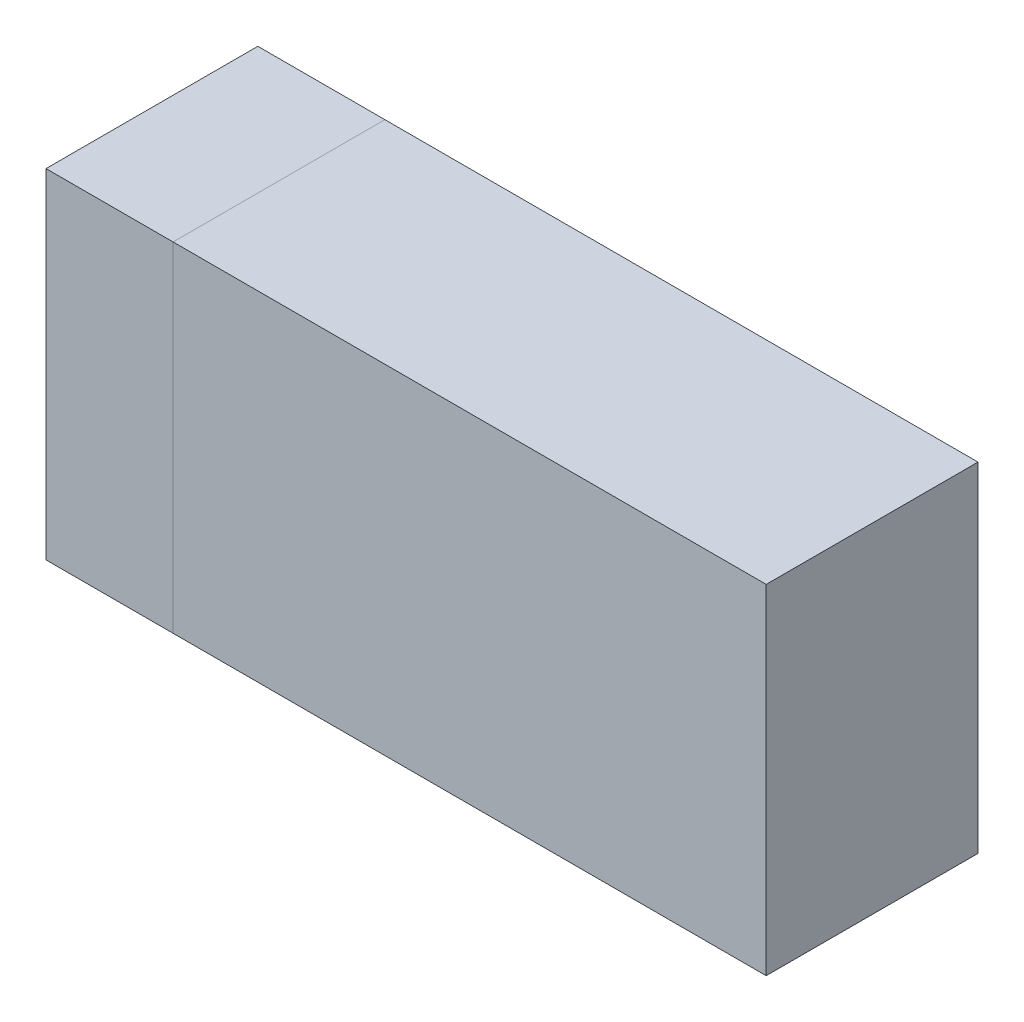
ISO-10303-21;
HEADER;
FILE_DESCRIPTION(('STEP AP214'),'2;1');
FILE_NAME('part.step','',(''),(''),'','','');
FILE_SCHEMA(('AUTOMOTIVE_DESIGN { 1 0 10303 214 1 1 1 1 }'));
ENDSEC;
DATA;
#1=APPLICATION_CONTEXT('core data for automotive mechanical design processes');
#2=APPLICATION_PROTOCOL_DEFINITION('international standard','automotive_design',2000,#1);
#3=PRODUCT_CONTEXT('',#1,'mechanical');
#4=PRODUCT('Part','Part','',(#3));
#5=PRODUCT_RELATED_PRODUCT_CATEGORY('part','',(#4));
#6=PRODUCT_DEFINITION_FORMATION('','',#4);
#7=PRODUCT_DEFINITION_CONTEXT('part definition',#1,'design');
#8=PRODUCT_DEFINITION('design','',#6,#7);
#9=PRODUCT_DEFINITION_SHAPE('','',#8);
#10=(LENGTH_UNIT() NAMED_UNIT(*) SI_UNIT(.MILLI.,.METRE.));
#11=(NAMED_UNIT(*) PLANE_ANGLE_UNIT() SI_UNIT($,.RADIAN.));
#12=(NAMED_UNIT(*) SI_UNIT($,.STERADIAN.) SOLID_ANGLE_UNIT());
#13=UNCERTAINTY_MEASURE_WITH_UNIT(LENGTH_MEASURE(1.E-05),#10,'distance_accuracy_value','');
#14=(GEOMETRIC_REPRESENTATION_CONTEXT(3) GLOBAL_UNCERTAINTY_ASSIGNED_CONTEXT((#13)) GLOBAL_UNIT_ASSIGNED_CONTEXT((#10,
#11,#12)) REPRESENTATION_CONTEXT('',''));
#15=CARTESIAN_POINT('',(0.,0.,0.));
#16=DIRECTION('',(0.,0.,1.));
#17=DIRECTION('',(1.,0.,0.));
#18=AXIS2_PLACEMENT_3D('',#15,#16,#17);
#19=CARTESIAN_POINT('',(-45.,35.075913733156,0.));
#20=DIRECTION('',(0.,0.,-1.));
#21=DIRECTION('',(-1.,0.,0.));
#22=AXIS2_PLACEMENT_3D('',#19,#20,#21);
#23=PLANE('',#22);
#24=DIRECTION('',(-1.,0.,0.));
#25=VECTOR('',#24,1.);
#26=CARTESIAN_POINT('',(-45.,5.07591373315601,0.));
#27=LINE('',#26,#25);
#28=CARTESIAN_POINT('',(-45.,5.07591373315601,0.));
#29=VERTEX_POINT('',#28);
#30=CARTESIAN_POINT('',(-70.,5.07591373315601,0.));
#31=VERTEX_POINT('',#30);
#32=EDGE_CURVE('E239',#29,#31,#27,.T.);
#33=ORIENTED_EDGE('',*,*,#32,.T.);
#34=DIRECTION('',(0.,-1.,0.));
#35=VECTOR('',#34,1.);
#36=CARTESIAN_POINT('',(-70.,0.,0.));
#37=LINE('',#36,#35);
#38=CARTESIAN_POINT('',(-70.,0.,0.));
#39=VERTEX_POINT('',#38);
#40=EDGE_CURVE('E215',#31,#39,#37,.T.);
#41=ORIENTED_EDGE('',*,*,#40,.T.);
#42=DIRECTION('',(1.,0.,0.));
#43=VECTOR('',#42,1.);
#44=CARTESIAN_POINT('',(-85.,0.,0.));
#45=LINE('',#44,#43);
#46=CARTESIAN_POINT('',(-85.,0.,0.));
#47=VERTEX_POINT('',#46);
#48=EDGE_CURVE('E209',#47,#39,#45,.T.);
#49=ORIENTED_EDGE('',*,*,#48,.F.);
#50=DIRECTION('',(0.,-1.,0.));
#51=VECTOR('',#50,1.);
#52=CARTESIAN_POINT('',(-85.,0.,0.));
#53=LINE('',#52,#51);
#54=CARTESIAN_POINT('',(-85.,40.,0.));
#55=VERTEX_POINT('',#54);
#56=EDGE_CURVE('E207',#55,#47,#53,.T.);
#57=ORIENTED_EDGE('',*,*,#56,.F.);
#58=DIRECTION('',(1.,0.,0.));
#59=VECTOR('',#58,1.);
#60=CARTESIAN_POINT('',(-85.,40.,0.));
#61=LINE('',#60,#59);
#62=CARTESIAN_POINT('',(-70.,40.,0.));
#63=VERTEX_POINT('',#62);
#64=EDGE_CURVE('E219',#55,#63,#61,.T.);
#65=ORIENTED_EDGE('',*,*,#64,.T.);
#66=CARTESIAN_POINT('',(-70.,35.075913733156,0.));
#67=VERTEX_POINT('',#66);
#68=EDGE_CURVE('E203',#63,#67,#37,.T.);
#69=ORIENTED_EDGE('',*,*,#68,.T.);
#70=DIRECTION('',(-1.,0.,0.));
#71=VECTOR('',#70,1.);
#72=CARTESIAN_POINT('',(-45.,35.075913733156,0.));
#73=LINE('',#72,#71);
#74=CARTESIAN_POINT('',(-45.,35.075913733156,0.));
#75=VERTEX_POINT('',#74);
#76=EDGE_CURVE('E77',#75,#67,#73,.T.);
#77=ORIENTED_EDGE('',*,*,#76,.F.);
#78=DIRECTION('',(0.,-1.,0.));
#79=VECTOR('',#78,1.);
#80=CARTESIAN_POINT('',(-45.,35.075913733156,0.));
#81=LINE('',#80,#79);
#82=EDGE_CURVE('E229',#75,#29,#81,.T.);
#83=ORIENTED_EDGE('',*,*,#82,.T.);
#84=EDGE_LOOP('',(#33,#41,#49,#57,#65,#69,#77,#83));
#85=FACE_BOUND('',#84,.T.);
#86=ADVANCED_FACE('F70',(#85),#23,.T.);
#87=CARTESIAN_POINT('',(-45.,35.075913733156,0.));
#88=DIRECTION('',(0.,-1.,0.));
#89=DIRECTION('',(0.,0.,-1.));
#90=AXIS2_PLACEMENT_3D('',#87,#88,#89);
#91=PLANE('',#90);
#92=DIRECTION('',(0.,0.,1.));
#93=VECTOR('',#92,1.);
#94=CARTESIAN_POINT('',(-70.,35.075913733156,0.));
#95=LINE('',#94,#93);
#96=CARTESIAN_POINT('',(-70.,35.075913733156,3.));
#97=VERTEX_POINT('',#96);
#98=EDGE_CURVE('E232',#67,#97,#95,.T.);
#99=ORIENTED_EDGE('',*,*,#98,.T.);
#100=DIRECTION('',(-1.,0.,0.));
#101=VECTOR('',#100,1.);
#102=CARTESIAN_POINT('',(-45.,35.075913733156,3.));
#103=LINE('',#102,#101);
#104=CARTESIAN_POINT('',(-45.,35.075913733156,3.));
#105=VERTEX_POINT('',#104);
#106=EDGE_CURVE('E245',#105,#97,#103,.T.);
#107=ORIENTED_EDGE('',*,*,#106,.F.);
#108=DIRECTION('',(0.,0.,1.));
#109=VECTOR('',#108,1.);
#110=CARTESIAN_POINT('',(-45.,35.075913733156,0.));
#111=LINE('',#110,#109);
#112=EDGE_CURVE('E237',#75,#105,#111,.T.);
#113=ORIENTED_EDGE('',*,*,#112,.F.);
#114=ORIENTED_EDGE('',*,*,#76,.T.);
#115=EDGE_LOOP('',(#99,#107,#113,#114));
#116=FACE_BOUND('',#115,.T.);
#117=ADVANCED_FACE('F280',(#116),#91,.F.);
#118=CARTESIAN_POINT('',(-45.,35.075913733156,3.));
#119=DIRECTION('',(0.,0.,-1.));
#120=DIRECTION('',(-1.,0.,0.));
#121=AXIS2_PLACEMENT_3D('',#118,#119,#120);
#122=PLANE('',#121);
#123=ORIENTED_EDGE('',*,*,#106,.T.);
#124=DIRECTION('',(0.,-1.,0.));
#125=VECTOR('',#124,1.);
#126=CARTESIAN_POINT('',(-70.,0.,3.));
#127=LINE('',#126,#125);
#128=CARTESIAN_POINT('',(-70.,37.,3.));
#129=VERTEX_POINT('',#128);
#130=EDGE_CURVE('E13',#129,#97,#127,.T.);
#131=ORIENTED_EDGE('',*,*,#130,.F.);
#132=DIRECTION('',(1.,0.,0.));
#133=VECTOR('',#132,1.);
#134=CARTESIAN_POINT('',(-77.,37.,3.));
#135=LINE('',#134,#133);
#136=CARTESIAN_POINT('',(-77.,37.,3.));
#137=VERTEX_POINT('',#136);
#138=EDGE_CURVE('E196',#137,#129,#135,.T.);
#139=ORIENTED_EDGE('',*,*,#138,.F.);
#140=DIRECTION('',(0.,1.,0.));
#141=VECTOR('',#140,1.);
#142=CARTESIAN_POINT('',(-77.,37.,3.));
#143=LINE('',#142,#141);
#144=CARTESIAN_POINT('',(-77.,3.,3.));
#145=VERTEX_POINT('',#144);
#146=EDGE_CURVE('E174',#145,#137,#143,.T.);
#147=ORIENTED_EDGE('',*,*,#146,.F.);
#148=DIRECTION('',(1.,0.,0.));
#149=VECTOR('',#148,1.);
#150=CARTESIAN_POINT('',(-77.,3.,3.));
#151=LINE('',#150,#149);
#152=CARTESIAN_POINT('',(-70.,3.,3.));
#153=VERTEX_POINT('',#152);
#154=EDGE_CURVE('E165',#145,#153,#151,.T.);
#155=ORIENTED_EDGE('',*,*,#154,.T.);
#156=DIRECTION('',(0.,1.,0.));
#157=VECTOR('',#156,1.);
#158=CARTESIAN_POINT('',(-70.,37.,3.));
#159=LINE('',#158,#157);
#160=CARTESIAN_POINT('',(-70.,5.07591373315601,3.));
#161=VERTEX_POINT('',#160);
#162=EDGE_CURVE('E181',#153,#161,#159,.T.);
#163=ORIENTED_EDGE('',*,*,#162,.T.);
#164=DIRECTION('',(-1.,0.,0.));
#165=VECTOR('',#164,1.);
#166=CARTESIAN_POINT('',(-45.,5.07591373315601,3.));
#167=LINE('',#166,#165);
#168=CARTESIAN_POINT('',(-45.,5.07591373315601,3.));
#169=VERTEX_POINT('',#168);
#170=EDGE_CURVE('E248',#169,#161,#167,.T.);
#171=ORIENTED_EDGE('',*,*,#170,.F.);
#172=DIRECTION('',(0.,-1.,0.));
#173=VECTOR('',#172,1.);
#174=CARTESIAN_POINT('',(-45.,35.075913733156,3.));
#175=LINE('',#174,#173);
#176=EDGE_CURVE('E235',#105,#169,#175,.T.);
#177=ORIENTED_EDGE('',*,*,#176,.F.);
#178=EDGE_LOOP('',(#123,#131,#139,#147,#155,#163,#171,#177));
#179=FACE_BOUND('',#178,.T.);
#180=ADVANCED_FACE('F286',(#179),#122,.F.);
#181=CARTESIAN_POINT('',(-45.,5.07591373315601,0.));
#182=DIRECTION('',(0.,-1.,0.));
#183=DIRECTION('',(0.,0.,-1.));
#184=AXIS2_PLACEMENT_3D('',#181,#182,#183);
#185=PLANE('',#184);
#186=DIRECTION('',(0.,0.,1.));
#187=VECTOR('',#186,1.);
#188=CARTESIAN_POINT('',(-70.,5.07591373315601,0.));
#189=LINE('',#188,#187);
#190=EDGE_CURVE('E228',#31,#161,#189,.T.);
#191=ORIENTED_EDGE('',*,*,#190,.F.);
#192=ORIENTED_EDGE('',*,*,#32,.F.);
#193=DIRECTION('',(0.,0.,1.));
#194=VECTOR('',#193,1.);
#195=CARTESIAN_POINT('',(-45.,5.07591373315601,0.));
#196=LINE('',#195,#194);
#197=EDGE_CURVE('E231',#29,#169,#196,.T.);
#198=ORIENTED_EDGE('',*,*,#197,.T.);
#199=ORIENTED_EDGE('',*,*,#170,.T.);
#200=EDGE_LOOP('',(#191,#192,#198,#199));
#201=FACE_BOUND('',#200,.T.);
#202=ADVANCED_FACE('F256',(#201),#185,.T.);
#203=CARTESIAN_POINT('',(-45.,0.,0.));
#204=DIRECTION('',(-1.,0.,0.));
#205=DIRECTION('',(0.,0.,1.));
#206=AXIS2_PLACEMENT_3D('',#203,#204,#205);
#207=PLANE('',#206);
#208=ORIENTED_EDGE('',*,*,#82,.F.);
#209=ORIENTED_EDGE('',*,*,#112,.T.);
#210=ORIENTED_EDGE('',*,*,#176,.T.);
#211=ORIENTED_EDGE('',*,*,#197,.F.);
#212=EDGE_LOOP('',(#208,#209,#210,#211));
#213=FACE_BOUND('',#212,.T.);
#214=ADVANCED_FACE('F284',(#213),#207,.F.);
#215=CARTESIAN_POINT('',(-70.,0.,0.));
#216=DIRECTION('',(-1.,0.,0.));
#217=DIRECTION('',(0.,0.,1.));
#218=AXIS2_PLACEMENT_3D('',#215,#216,#217);
#219=PLANE('',#218);
#220=DIRECTION('',(0.,0.,1.));
#221=VECTOR('',#220,1.);
#222=CARTESIAN_POINT('',(-70.,37.,22.));
#223=LINE('',#222,#221);
#224=CARTESIAN_POINT('',(-70.,37.,22.));
#225=VERTEX_POINT('',#224);
#226=EDGE_CURVE('E178',#129,#225,#223,.T.);
#227=ORIENTED_EDGE('',*,*,#226,.F.);
#228=ORIENTED_EDGE('',*,*,#130,.T.);
#229=ORIENTED_EDGE('',*,*,#98,.F.);
#230=ORIENTED_EDGE('',*,*,#68,.F.);
#231=DIRECTION('',(0.,0.,-1.));
#232=VECTOR('',#231,1.);
#233=CARTESIAN_POINT('',(-70.,40.,0.));
#234=LINE('',#233,#232);
#235=CARTESIAN_POINT('',(-70.,40.,25.));
#236=VERTEX_POINT('',#235);
#237=EDGE_CURVE('E213',#236,#63,#234,.T.);
#238=ORIENTED_EDGE('',*,*,#237,.F.);
#239=DIRECTION('',(0.,1.,0.));
#240=VECTOR('',#239,1.);
#241=CARTESIAN_POINT('',(-70.,0.,25.));
#242=LINE('',#241,#240);
#243=CARTESIAN_POINT('',(-70.,0.,25.));
#244=VERTEX_POINT('',#243);
#245=EDGE_CURVE('E211',#244,#236,#242,.T.);
#246=ORIENTED_EDGE('',*,*,#245,.F.);
#247=DIRECTION('',(0.,0.,1.));
#248=VECTOR('',#247,1.);
#249=CARTESIAN_POINT('',(-70.,0.,0.));
#250=LINE('',#249,#248);
#251=EDGE_CURVE('E195',#39,#244,#250,.T.);
#252=ORIENTED_EDGE('',*,*,#251,.F.);
#253=ORIENTED_EDGE('',*,*,#40,.F.);
#254=ORIENTED_EDGE('',*,*,#190,.T.);
#255=ORIENTED_EDGE('',*,*,#162,.F.);
#256=DIRECTION('',(0.,0.,-1.));
#257=VECTOR('',#256,1.);
#258=CARTESIAN_POINT('',(-70.,3.,22.));
#259=LINE('',#258,#257);
#260=CARTESIAN_POINT('',(-70.,3.,22.));
#261=VERTEX_POINT('',#260);
#262=EDGE_CURVE('E190',#261,#153,#259,.T.);
#263=ORIENTED_EDGE('',*,*,#262,.F.);
#264=DIRECTION('',(0.,-1.,0.));
#265=VECTOR('',#264,1.);
#266=CARTESIAN_POINT('',(-70.,37.,22.));
#267=LINE('',#266,#265);
#268=EDGE_CURVE('E84',#225,#261,#267,.T.);
#269=ORIENTED_EDGE('',*,*,#268,.F.);
#270=EDGE_LOOP('',(#227,#228,#229,#230,#238,#246,#252,#253,#254,#255,#263,#269));
#271=FACE_BOUND('',#270,.T.);
#272=ADVANCED_FACE('F261',(#271),#219,.F.);
#273=CARTESIAN_POINT('',(-85.,0.,25.));
#274=DIRECTION('',(0.,0.,-1.));
#275=DIRECTION('',(-1.,0.,0.));
#276=AXIS2_PLACEMENT_3D('',#273,#274,#275);
#277=PLANE('',#276);
#278=ORIENTED_EDGE('',*,*,#245,.T.);
#279=DIRECTION('',(1.,0.,0.));
#280=VECTOR('',#279,1.);
#281=CARTESIAN_POINT('',(-85.,40.,25.));
#282=LINE('',#281,#280);
#283=CARTESIAN_POINT('',(-85.,40.,25.));
#284=VERTEX_POINT('',#283);
#285=EDGE_CURVE('E222',#284,#236,#282,.T.);
#286=ORIENTED_EDGE('',*,*,#285,.F.);
#287=DIRECTION('',(0.,1.,0.));
#288=VECTOR('',#287,1.);
#289=CARTESIAN_POINT('',(-85.,0.,25.));
#290=LINE('',#289,#288);
#291=CARTESIAN_POINT('',(-85.,0.,25.));
#292=VERTEX_POINT('',#291);
#293=EDGE_CURVE('E202',#292,#284,#290,.T.);
#294=ORIENTED_EDGE('',*,*,#293,.F.);
#295=DIRECTION('',(1.,0.,0.));
#296=VECTOR('',#295,1.);
#297=CARTESIAN_POINT('',(-85.,0.,25.));
#298=LINE('',#297,#296);
#299=EDGE_CURVE('E225',#292,#244,#298,.T.);
#300=ORIENTED_EDGE('',*,*,#299,.T.);
#301=EDGE_LOOP('',(#278,#286,#294,#300));
#302=FACE_BOUND('',#301,.T.);
#303=ADVANCED_FACE('F316',(#302),#277,.F.);
#304=CARTESIAN_POINT('',(-85.,0.,0.));
#305=DIRECTION('',(0.,1.,0.));
#306=DIRECTION('',(0.,0.,1.));
#307=AXIS2_PLACEMENT_3D('',#304,#305,#306);
#308=PLANE('',#307);
#309=ORIENTED_EDGE('',*,*,#251,.T.);
#310=ORIENTED_EDGE('',*,*,#299,.F.);
#311=DIRECTION('',(0.,0.,1.));
#312=VECTOR('',#311,1.);
#313=CARTESIAN_POINT('',(-85.,0.,0.));
#314=LINE('',#313,#312);
#315=EDGE_CURVE('E200',#47,#292,#314,.T.);
#316=ORIENTED_EDGE('',*,*,#315,.F.);
#317=ORIENTED_EDGE('',*,*,#48,.T.);
#318=EDGE_LOOP('',(#309,#310,#316,#317));
#319=FACE_BOUND('',#318,.T.);
#320=ADVANCED_FACE('F267',(#319),#308,.F.);
#321=CARTESIAN_POINT('',(-85.,40.,0.));
#322=DIRECTION('',(0.,-1.,0.));
#323=DIRECTION('',(0.,0.,-1.));
#324=AXIS2_PLACEMENT_3D('',#321,#322,#323);
#325=PLANE('',#324);
#326=ORIENTED_EDGE('',*,*,#64,.F.);
#327=DIRECTION('',(0.,0.,-1.));
#328=VECTOR('',#327,1.);
#329=CARTESIAN_POINT('',(-85.,40.,0.));
#330=LINE('',#329,#328);
#331=EDGE_CURVE('E205',#284,#55,#330,.T.);
#332=ORIENTED_EDGE('',*,*,#331,.F.);
#333=ORIENTED_EDGE('',*,*,#285,.T.);
#334=ORIENTED_EDGE('',*,*,#237,.T.);
#335=EDGE_LOOP('',(#326,#332,#333,#334));
#336=FACE_BOUND('',#335,.T.);
#337=ADVANCED_FACE('F278',(#336),#325,.F.);
#338=CARTESIAN_POINT('',(-85.,0.,0.));
#339=DIRECTION('',(-1.,0.,0.));
#340=DIRECTION('',(0.,0.,1.));
#341=AXIS2_PLACEMENT_3D('',#338,#339,#340);
#342=PLANE('',#341);
#343=ORIENTED_EDGE('',*,*,#315,.T.);
#344=ORIENTED_EDGE('',*,*,#293,.T.);
#345=ORIENTED_EDGE('',*,*,#331,.T.);
#346=ORIENTED_EDGE('',*,*,#56,.T.);
#347=EDGE_LOOP('',(#343,#344,#345,#346));
#348=FACE_BOUND('',#347,.T.);
#349=ADVANCED_FACE('F273',(#348),#342,.T.);
#350=CARTESIAN_POINT('',(-77.,37.,22.));
#351=DIRECTION('',(0.,0.,1.));
#352=DIRECTION('',(0.,-1.,0.));
#353=AXIS2_PLACEMENT_3D('',#350,#351,#352);
#354=PLANE('',#353);
#355=ORIENTED_EDGE('',*,*,#268,.T.);
#356=DIRECTION('',(1.,0.,0.));
#357=VECTOR('',#356,1.);
#358=CARTESIAN_POINT('',(-77.,3.,22.));
#359=LINE('',#358,#357);
#360=CARTESIAN_POINT('',(-77.,3.,22.));
#361=VERTEX_POINT('',#360);
#362=EDGE_CURVE('E156',#361,#261,#359,.T.);
#363=ORIENTED_EDGE('',*,*,#362,.F.);
#364=DIRECTION('',(0.,-1.,0.));
#365=VECTOR('',#364,1.);
#366=CARTESIAN_POINT('',(-77.,37.,22.));
#367=LINE('',#366,#365);
#368=CARTESIAN_POINT('',(-77.,37.,22.));
#369=VERTEX_POINT('',#368);
#370=EDGE_CURVE('E160',#369,#361,#367,.T.);
#371=ORIENTED_EDGE('',*,*,#370,.F.);
#372=DIRECTION('',(1.,0.,0.));
#373=VECTOR('',#372,1.);
#374=CARTESIAN_POINT('',(-77.,37.,22.));
#375=LINE('',#374,#373);
#376=EDGE_CURVE('E193',#369,#225,#375,.T.);
#377=ORIENTED_EDGE('',*,*,#376,.T.);
#378=EDGE_LOOP('',(#355,#363,#371,#377));
#379=FACE_BOUND('',#378,.T.);
#380=ADVANCED_FACE('F158',(#379),#354,.F.);
#381=CARTESIAN_POINT('',(-77.,37.,22.));
#382=DIRECTION('',(0.,1.,0.));
#383=DIRECTION('',(0.,0.,1.));
#384=AXIS2_PLACEMENT_3D('',#381,#382,#383);
#385=PLANE('',#384);
#386=ORIENTED_EDGE('',*,*,#226,.T.);
#387=ORIENTED_EDGE('',*,*,#376,.F.);
#388=DIRECTION('',(0.,0.,1.));
#389=VECTOR('',#388,1.);
#390=CARTESIAN_POINT('',(-77.,37.,22.));
#391=LINE('',#390,#389);
#392=EDGE_CURVE('E166',#137,#369,#391,.T.);
#393=ORIENTED_EDGE('',*,*,#392,.F.);
#394=ORIENTED_EDGE('',*,*,#138,.T.);
#395=EDGE_LOOP('',(#386,#387,#393,#394));
#396=FACE_BOUND('',#395,.T.);
#397=ADVANCED_FACE('F288',(#396),#385,.F.);
#398=CARTESIAN_POINT('',(-77.,3.,22.));
#399=DIRECTION('',(0.,-1.,0.));
#400=DIRECTION('',(0.,0.,-1.));
#401=AXIS2_PLACEMENT_3D('',#398,#399,#400);
#402=PLANE('',#401);
#403=ORIENTED_EDGE('',*,*,#262,.T.);
#404=ORIENTED_EDGE('',*,*,#154,.F.);
#405=DIRECTION('',(0.,0.,-1.));
#406=VECTOR('',#405,1.);
#407=CARTESIAN_POINT('',(-77.,3.,22.));
#408=LINE('',#407,#406);
#409=EDGE_CURVE('E169',#361,#145,#408,.T.);
#410=ORIENTED_EDGE('',*,*,#409,.F.);
#411=ORIENTED_EDGE('',*,*,#362,.T.);
#412=EDGE_LOOP('',(#403,#404,#410,#411));
#413=FACE_BOUND('',#412,.T.);
#414=ADVANCED_FACE('F170',(#413),#402,.F.);
#415=CARTESIAN_POINT('',(-77.,0.,0.));
#416=DIRECTION('',(1.,0.,0.));
#417=DIRECTION('',(0.,0.,-1.));
#418=AXIS2_PLACEMENT_3D('',#415,#416,#417);
#419=PLANE('',#418);
#420=CARTESIAN_POINT('',(-77.,20.,11.));
#421=DIRECTION('',(1.,0.,0.));
#422=DIRECTION('',(0.,0.,-1.));
#423=AXIS2_PLACEMENT_3D('',#420,#421,#422);
#424=CIRCLE('',#423,4.);
#425=CARTESIAN_POINT('',(-77.,20.,7.00000000000001));
#426=VERTEX_POINT('',#425);
#427=EDGE_CURVE('E184',#426,#426,#424,.T.);
#428=ORIENTED_EDGE('',*,*,#427,.F.);
#429=EDGE_LOOP('',(#428));
#430=FACE_BOUND('',#429,.T.);
#431=ORIENTED_EDGE('',*,*,#370,.T.);
#432=ORIENTED_EDGE('',*,*,#409,.T.);
#433=ORIENTED_EDGE('',*,*,#146,.T.);
#434=ORIENTED_EDGE('',*,*,#392,.T.);
#435=EDGE_LOOP('',(#431,#432,#433,#434));
#436=FACE_BOUND('',#435,.T.);
#437=ADVANCED_FACE('F176',(#430,#436),#419,.T.);
#438=CARTESIAN_POINT('',(-79.,20.,11.));
#439=DIRECTION('',(1.,0.,0.));
#440=DIRECTION('',(0.,0.,-1.));
#441=AXIS2_PLACEMENT_3D('',#438,#439,#440);
#442=CYLINDRICAL_SURFACE('',#441,4.);
#443=ORIENTED_EDGE('',*,*,#427,.T.);
#444=EDGE_LOOP('',(#443));
#445=FACE_BOUND('',#444,.T.);
#446=CARTESIAN_POINT('',(-79.,20.,11.));
#447=DIRECTION('',(1.,0.,0.));
#448=DIRECTION('',(0.,0.,-1.));
#449=AXIS2_PLACEMENT_3D('',#446,#447,#448);
#450=CIRCLE('',#449,4.);
#451=CARTESIAN_POINT('',(-79.,20.,7.00000000000001));
#452=VERTEX_POINT('',#451);
#453=EDGE_CURVE('E391',#452,#452,#450,.T.);
#454=ORIENTED_EDGE('',*,*,#453,.F.);
#455=EDGE_LOOP('',(#454));
#456=FACE_BOUND('',#455,.T.);
#457=ADVANCED_FACE('F366',(#445,#456),#442,.F.);
#458=CARTESIAN_POINT('',(-79.,0.,0.));
#459=DIRECTION('',(1.,0.,0.));
#460=DIRECTION('',(0.,0.,-1.));
#461=AXIS2_PLACEMENT_3D('',#458,#459,#460);
#462=PLANE('',#461);
#463=ORIENTED_EDGE('',*,*,#453,.T.);
#464=EDGE_LOOP('',(#463));
#465=FACE_BOUND('',#464,.T.);
#466=ADVANCED_FACE('F375',(#465),#462,.T.);
#467=CLOSED_SHELL('',(#86,#117,#180,#202,#214,#272,#303,#320,#337,#349,#380,#397,#414,#437,#457,#466));
#468=MANIFOLD_SOLID_BREP('B2',#467);
#469=CARTESIAN_POINT('',(0.,5.,25.));
#470=DIRECTION('',(0.,-1.,0.));
#471=DIRECTION('',(1.,0.,0.));
#472=AXIS2_PLACEMENT_3D('',#469,#470,#471);
#473=PLANE('',#472);
#474=DIRECTION('',(0.,0.,1.));
#475=VECTOR('',#474,1.);
#476=CARTESIAN_POINT('',(-60.,5.,0.));
#477=LINE('',#476,#475);
#478=CARTESIAN_POINT('',(-60.,4.99999999999999,0.));
#479=VERTEX_POINT('',#478);
#480=CARTESIAN_POINT('',(-60.,4.99999999999999,22.));
#481=VERTEX_POINT('',#480);
#482=EDGE_CURVE('E512',#479,#481,#477,.T.);
#483=ORIENTED_EDGE('',*,*,#482,.F.);
#484=DIRECTION('',(-1.,0.,0.));
#485=VECTOR('',#484,1.);
#486=CARTESIAN_POINT('',(0.,5.,0.));
#487=LINE('',#486,#485);
#488=CARTESIAN_POINT('',(-70.,4.99999999999999,0.));
#489=VERTEX_POINT('',#488);
#490=EDGE_CURVE('E611',#479,#489,#487,.T.);
#491=ORIENTED_EDGE('',*,*,#490,.T.);
#492=DIRECTION('',(0.,0.,-1.));
#493=VECTOR('',#492,1.);
#494=CARTESIAN_POINT('',(-70.,4.99999999999999,25.));
#495=LINE('',#494,#493);
#496=CARTESIAN_POINT('',(-70.,4.99999999999999,22.));
#497=VERTEX_POINT('',#496);
#498=EDGE_CURVE('E653',#497,#489,#495,.T.);
#499=ORIENTED_EDGE('',*,*,#498,.F.);
#500=DIRECTION('',(1.,0.,0.));
#501=VECTOR('',#500,1.);
#502=CARTESIAN_POINT('',(0.,5.,22.));
#503=LINE('',#502,#501);
#504=EDGE_CURVE('E692',#497,#481,#503,.T.);
#505=ORIENTED_EDGE('',*,*,#504,.T.);
#506=EDGE_LOOP('',(#483,#491,#499,#505));
#507=FACE_BOUND('',#506,.T.);
#508=ADVANCED_FACE('F490',(#507),#473,.F.);
#509=CARTESIAN_POINT('',(-70.,0.,22.));
#510=DIRECTION('',(0.,0.,-1.));
#511=DIRECTION('',(-1.,0.,0.));
#512=AXIS2_PLACEMENT_3D('',#509,#510,#511);
#513=PLANE('',#512);
#514=DIRECTION('',(-1.,0.,0.));
#515=VECTOR('',#514,1.);
#516=CARTESIAN_POINT('',(0.,35.,22.));
#517=LINE('',#516,#515);
#518=CARTESIAN_POINT('',(-60.,35.,22.));
#519=VERTEX_POINT('',#518);
#520=CARTESIAN_POINT('',(-70.,35.,22.));
#521=VERTEX_POINT('',#520);
#522=EDGE_CURVE('E637',#519,#521,#517,.T.);
#523=ORIENTED_EDGE('',*,*,#522,.F.);
#524=DIRECTION('',(0.,1.,0.));
#525=VECTOR('',#524,1.);
#526=CARTESIAN_POINT('',(-60.,5.,22.));
#527=LINE('',#526,#525);
#528=EDGE_CURVE('E618',#481,#519,#527,.T.);
#529=ORIENTED_EDGE('',*,*,#528,.F.);
#530=ORIENTED_EDGE('',*,*,#504,.F.);
#531=DIRECTION('',(0.,1.,0.));
#532=VECTOR('',#531,1.);
#533=CARTESIAN_POINT('',(-70.,0.,22.));
#534=LINE('',#533,#532);
#535=EDGE_CURVE('E628',#497,#521,#534,.T.);
#536=ORIENTED_EDGE('',*,*,#535,.T.);
#537=EDGE_LOOP('',(#523,#529,#530,#536));
#538=FACE_BOUND('',#537,.T.);
#539=ADVANCED_FACE('F733',(#538),#513,.T.);
#540=CARTESIAN_POINT('',(0.,0.,25.));
#541=DIRECTION('',(0.,1.,0.));
#542=DIRECTION('',(0.,0.,1.));
#543=AXIS2_PLACEMENT_3D('',#540,#541,#542);
#544=PLANE('',#543);
#545=DIRECTION('',(1.,0.,0.));
#546=VECTOR('',#545,1.);
#547=CARTESIAN_POINT('',(0.,0.,0.));
#548=LINE('',#547,#546);
#549=CARTESIAN_POINT('',(-70.,0.,0.));
#550=VERTEX_POINT('',#549);
#551=CARTESIAN_POINT('',(0.,0.,0.));
#552=VERTEX_POINT('',#551);
#553=EDGE_CURVE('E656',#550,#552,#548,.T.);
#554=ORIENTED_EDGE('',*,*,#553,.T.);
#555=DIRECTION('',(0.,0.,-1.));
#556=VECTOR('',#555,1.);
#557=CARTESIAN_POINT('',(0.,0.,25.));
#558=LINE('',#557,#556);
#559=CARTESIAN_POINT('',(0.,0.,25.));
#560=VERTEX_POINT('',#559);
#561=EDGE_CURVE('E687',#560,#552,#558,.T.);
#562=ORIENTED_EDGE('',*,*,#561,.F.);
#563=DIRECTION('',(1.,0.,0.));
#564=VECTOR('',#563,1.);
#565=CARTESIAN_POINT('',(0.,0.,25.));
#566=LINE('',#565,#564);
#567=CARTESIAN_POINT('',(-70.,0.,25.));
#568=VERTEX_POINT('',#567);
#569=EDGE_CURVE('E645',#568,#560,#566,.T.);
#570=ORIENTED_EDGE('',*,*,#569,.F.);
#571=DIRECTION('',(0.,0.,-1.));
#572=VECTOR('',#571,1.);
#573=CARTESIAN_POINT('',(-70.,0.,25.));
#574=LINE('',#573,#572);
#575=EDGE_CURVE('E689',#568,#550,#574,.T.);
#576=ORIENTED_EDGE('',*,*,#575,.T.);
#577=EDGE_LOOP('',(#554,#562,#570,#576));
#578=FACE_BOUND('',#577,.T.);
#579=ADVANCED_FACE('F492',(#578),#544,.F.);
#580=CARTESIAN_POINT('',(0.,0.,25.));
#581=DIRECTION('',(-1.,0.,0.));
#582=DIRECTION('',(0.,0.,1.));
#583=AXIS2_PLACEMENT_3D('',#580,#581,#582);
#584=PLANE('',#583);
#585=DIRECTION('',(0.,1.,0.));
#586=VECTOR('',#585,1.);
#587=CARTESIAN_POINT('',(0.,0.,0.));
#588=LINE('',#587,#586);
#589=CARTESIAN_POINT('',(0.,40.,0.));
#590=VERTEX_POINT('',#589);
#591=EDGE_CURVE('E659',#552,#590,#588,.T.);
#592=ORIENTED_EDGE('',*,*,#591,.T.);
#593=DIRECTION('',(0.,0.,-1.));
#594=VECTOR('',#593,1.);
#595=CARTESIAN_POINT('',(0.,40.,25.));
#596=LINE('',#595,#594);
#597=CARTESIAN_POINT('',(0.,40.,25.));
#598=VERTEX_POINT('',#597);
#599=EDGE_CURVE('E685',#598,#590,#596,.T.);
#600=ORIENTED_EDGE('',*,*,#599,.F.);
#601=DIRECTION('',(0.,1.,0.));
#602=VECTOR('',#601,1.);
#603=CARTESIAN_POINT('',(0.,0.,25.));
#604=LINE('',#603,#602);
#605=EDGE_CURVE('E648',#560,#598,#604,.T.);
#606=ORIENTED_EDGE('',*,*,#605,.F.);
#607=ORIENTED_EDGE('',*,*,#561,.T.);
#608=EDGE_LOOP('',(#592,#600,#606,#607));
#609=FACE_BOUND('',#608,.T.);
#610=ADVANCED_FACE('F728',(#609),#584,.F.);
#611=CARTESIAN_POINT('',(0.,40.,25.));
#612=DIRECTION('',(0.,-1.,0.));
#613=DIRECTION('',(1.,0.,0.));
#614=AXIS2_PLACEMENT_3D('',#611,#612,#613);
#615=PLANE('',#614);
#616=DIRECTION('',(-1.,0.,0.));
#617=VECTOR('',#616,1.);
#618=CARTESIAN_POINT('',(0.,40.,0.));
#619=LINE('',#618,#617);
#620=CARTESIAN_POINT('',(-70.,40.,0.));
#621=VERTEX_POINT('',#620);
#622=EDGE_CURVE('E662',#590,#621,#619,.T.);
#623=ORIENTED_EDGE('',*,*,#622,.T.);
#624=DIRECTION('',(0.,0.,-1.));
#625=VECTOR('',#624,1.);
#626=CARTESIAN_POINT('',(-70.,40.,25.));
#627=LINE('',#626,#625);
#628=CARTESIAN_POINT('',(-70.,40.,25.));
#629=VERTEX_POINT('',#628);
#630=EDGE_CURVE('E683',#629,#621,#627,.T.);
#631=ORIENTED_EDGE('',*,*,#630,.F.);
#632=DIRECTION('',(-1.,0.,0.));
#633=VECTOR('',#632,1.);
#634=CARTESIAN_POINT('',(0.,40.,25.));
#635=LINE('',#634,#633);
#636=EDGE_CURVE('E650',#598,#629,#635,.T.);
#637=ORIENTED_EDGE('',*,*,#636,.F.);
#638=ORIENTED_EDGE('',*,*,#599,.T.);
#639=EDGE_LOOP('',(#623,#631,#637,#638));
#640=FACE_BOUND('',#639,.T.);
#641=ADVANCED_FACE('F724',(#640),#615,.F.);
#642=CARTESIAN_POINT('',(-70.,0.,25.));
#643=DIRECTION('',(1.,0.,0.));
#644=DIRECTION('',(0.,0.,-1.));
#645=AXIS2_PLACEMENT_3D('',#642,#643,#644);
#646=PLANE('',#645);
#647=DIRECTION('',(0.,0.,-1.));
#648=VECTOR('',#647,1.);
#649=CARTESIAN_POINT('',(-70.,35.,25.));
#650=LINE('',#649,#648);
#651=CARTESIAN_POINT('',(-70.,35.,0.));
#652=VERTEX_POINT('',#651);
#653=EDGE_CURVE('E681',#521,#652,#650,.T.);
#654=ORIENTED_EDGE('',*,*,#653,.F.);
#655=ORIENTED_EDGE('',*,*,#535,.F.);
#656=ORIENTED_EDGE('',*,*,#498,.T.);
#657=DIRECTION('',(0.,-1.,0.));
#658=VECTOR('',#657,1.);
#659=CARTESIAN_POINT('',(-70.,0.,0.));
#660=LINE('',#659,#658);
#661=EDGE_CURVE('E641',#489,#550,#660,.T.);
#662=ORIENTED_EDGE('',*,*,#661,.T.);
#663=ORIENTED_EDGE('',*,*,#575,.F.);
#664=DIRECTION('',(0.,-1.,0.));
#665=VECTOR('',#664,1.);
#666=CARTESIAN_POINT('',(-70.,0.,25.));
#667=LINE('',#666,#665);
#668=EDGE_CURVE('E642',#629,#568,#667,.T.);
#669=ORIENTED_EDGE('',*,*,#668,.F.);
#670=ORIENTED_EDGE('',*,*,#630,.T.);
#671=DIRECTION('',(0.,-1.,0.));
#672=VECTOR('',#671,1.);
#673=CARTESIAN_POINT('',(-70.,0.,0.));
#674=LINE('',#673,#672);
#675=EDGE_CURVE('E665',#621,#652,#674,.T.);
#676=ORIENTED_EDGE('',*,*,#675,.T.);
#677=EDGE_LOOP('',(#654,#655,#656,#662,#663,#669,#670,#676));
#678=FACE_BOUND('',#677,.T.);
#679=ADVANCED_FACE('F719',(#678),#646,.F.);
#680=CARTESIAN_POINT('',(0.,35.,25.));
#681=DIRECTION('',(0.,1.,0.));
#682=DIRECTION('',(0.,0.,1.));
#683=AXIS2_PLACEMENT_3D('',#680,#681,#682);
#684=PLANE('',#683);
#685=DIRECTION('',(0.,0.,1.));
#686=VECTOR('',#685,1.);
#687=CARTESIAN_POINT('',(-55.,35.,0.));
#688=LINE('',#687,#686);
#689=CARTESIAN_POINT('',(-55.,35.,3.));
#690=VERTEX_POINT('',#689);
#691=CARTESIAN_POINT('',(-55.,35.,22.));
#692=VERTEX_POINT('',#691);
#693=EDGE_CURVE('E616',#690,#692,#688,.T.);
#694=ORIENTED_EDGE('',*,*,#693,.F.);
#695=DIRECTION('',(-1.,0.,0.));
#696=VECTOR('',#695,1.);
#697=CARTESIAN_POINT('',(-53.,35.,3.));
#698=LINE('',#697,#696);
#699=CARTESIAN_POINT('',(-60.,35.,3.));
#700=VERTEX_POINT('',#699);
#701=EDGE_CURVE('E624',#690,#700,#698,.T.);
#702=ORIENTED_EDGE('',*,*,#701,.T.);
#703=DIRECTION('',(0.,0.,1.));
#704=VECTOR('',#703,1.);
#705=CARTESIAN_POINT('',(-60.,35.,0.));
#706=LINE('',#705,#704);
#707=EDGE_CURVE('E629',#700,#519,#706,.T.);
#708=ORIENTED_EDGE('',*,*,#707,.T.);
#709=ORIENTED_EDGE('',*,*,#522,.T.);
#710=ORIENTED_EDGE('',*,*,#653,.T.);
#711=DIRECTION('',(1.,0.,0.));
#712=VECTOR('',#711,1.);
#713=CARTESIAN_POINT('',(0.,35.,0.));
#714=LINE('',#713,#712);
#715=CARTESIAN_POINT('',(-4.99999999999999,35.,0.));
#716=VERTEX_POINT('',#715);
#717=EDGE_CURVE('E668',#652,#716,#714,.T.);
#718=ORIENTED_EDGE('',*,*,#717,.T.);
#719=DIRECTION('',(0.,0.,-1.));
#720=VECTOR('',#719,1.);
#721=CARTESIAN_POINT('',(-4.99999999999999,35.,25.));
#722=LINE('',#721,#720);
#723=CARTESIAN_POINT('',(-4.99999999999999,35.,22.));
#724=VERTEX_POINT('',#723);
#725=EDGE_CURVE('E678',#724,#716,#722,.T.);
#726=ORIENTED_EDGE('',*,*,#725,.F.);
#727=EDGE_CURVE('E638',#724,#692,#517,.T.);
#728=ORIENTED_EDGE('',*,*,#727,.T.);
#729=EDGE_LOOP('',(#694,#702,#708,#709,#710,#718,#726,#728));
#730=FACE_BOUND('',#729,.T.);
#731=ADVANCED_FACE('F713',(#730),#684,.F.);
#732=CARTESIAN_POINT('',(-5.,0.,25.));
#733=DIRECTION('',(1.,0.,0.));
#734=DIRECTION('',(0.,1.,0.));
#735=AXIS2_PLACEMENT_3D('',#732,#733,#734);
#736=PLANE('',#735);
#737=DIRECTION('',(0.,0.,-1.));
#738=VECTOR('',#737,1.);
#739=CARTESIAN_POINT('',(-4.99999999999999,5.,25.));
#740=LINE('',#739,#738);
#741=CARTESIAN_POINT('',(-4.99999999999999,5.,22.));
#742=VERTEX_POINT('',#741);
#743=CARTESIAN_POINT('',(-4.99999999999999,5.,0.));
#744=VERTEX_POINT('',#743);
#745=EDGE_CURVE('E676',#742,#744,#740,.T.);
#746=ORIENTED_EDGE('',*,*,#745,.F.);
#747=DIRECTION('',(0.,1.,0.));
#748=VECTOR('',#747,1.);
#749=CARTESIAN_POINT('',(-5.,0.,22.));
#750=LINE('',#749,#748);
#751=EDGE_CURVE('E634',#742,#724,#750,.T.);
#752=ORIENTED_EDGE('',*,*,#751,.T.);
#753=ORIENTED_EDGE('',*,*,#725,.T.);
#754=DIRECTION('',(0.,-1.,0.));
#755=VECTOR('',#754,1.);
#756=CARTESIAN_POINT('',(-5.,0.,0.));
#757=LINE('',#756,#755);
#758=EDGE_CURVE('E670',#716,#744,#757,.T.);
#759=ORIENTED_EDGE('',*,*,#758,.T.);
#760=EDGE_LOOP('',(#746,#752,#753,#759));
#761=FACE_BOUND('',#760,.T.);
#762=ADVANCED_FACE('F705',(#761),#736,.F.);
#763=CARTESIAN_POINT('',(-55.,4.99999999999999,0.));
#764=VERTEX_POINT('',#763);
#765=EDGE_CURVE('E646',#744,#764,#487,.T.);
#766=ORIENTED_EDGE('',*,*,#765,.T.);
#767=DIRECTION('',(0.,0.,1.));
#768=VECTOR('',#767,1.);
#769=CARTESIAN_POINT('',(-55.,5.,0.));
#770=LINE('',#769,#768);
#771=CARTESIAN_POINT('',(-55.,5.,22.));
#772=VERTEX_POINT('',#771);
#773=EDGE_CURVE('E612',#764,#772,#770,.T.);
#774=ORIENTED_EDGE('',*,*,#773,.T.);
#775=EDGE_CURVE('E691',#772,#742,#503,.T.);
#776=ORIENTED_EDGE('',*,*,#775,.T.);
#777=ORIENTED_EDGE('',*,*,#745,.T.);
#778=EDGE_LOOP('',(#766,#774,#776,#777));
#779=FACE_BOUND('',#778,.T.);
#780=ADVANCED_FACE('F697',(#779),#473,.F.);
#781=CARTESIAN_POINT('',(0.,0.,25.));
#782=DIRECTION('',(0.,0.,1.));
#783=DIRECTION('',(1.,0.,0.));
#784=AXIS2_PLACEMENT_3D('',#781,#782,#783);
#785=PLANE('',#784);
#786=ORIENTED_EDGE('',*,*,#668,.T.);
#787=ORIENTED_EDGE('',*,*,#569,.T.);
#788=ORIENTED_EDGE('',*,*,#605,.T.);
#789=ORIENTED_EDGE('',*,*,#636,.T.);
#790=EDGE_LOOP('',(#786,#787,#788,#789));
#791=FACE_BOUND('',#790,.T.);
#792=ADVANCED_FACE('F743',(#791),#785,.T.);
#793=CARTESIAN_POINT('',(0.,0.,0.));
#794=DIRECTION('',(0.,0.,1.));
#795=DIRECTION('',(1.,0.,0.));
#796=AXIS2_PLACEMENT_3D('',#793,#794,#795);
#797=PLANE('',#796);
#798=ORIENTED_EDGE('',*,*,#758,.F.);
#799=ORIENTED_EDGE('',*,*,#717,.F.);
#800=ORIENTED_EDGE('',*,*,#675,.F.);
#801=ORIENTED_EDGE('',*,*,#622,.F.);
#802=ORIENTED_EDGE('',*,*,#591,.F.);
#803=ORIENTED_EDGE('',*,*,#553,.F.);
#804=ORIENTED_EDGE('',*,*,#661,.F.);
#805=ORIENTED_EDGE('',*,*,#490,.F.);
#806=DIRECTION('',(0.,1.,0.));
#807=VECTOR('',#806,1.);
#808=CARTESIAN_POINT('',(-60.,5.,0.));
#809=LINE('',#808,#807);
#810=CARTESIAN_POINT('',(-60.,5.07591373315601,0.));
#811=VERTEX_POINT('',#810);
#812=EDGE_CURVE('E605',#479,#811,#809,.T.);
#813=ORIENTED_EDGE('',*,*,#812,.T.);
#814=DIRECTION('',(-1.,0.,0.));
#815=VECTOR('',#814,1.);
#816=CARTESIAN_POINT('',(-53.,5.07591373315601,0.));
#817=LINE('',#816,#815);
#818=CARTESIAN_POINT('',(-55.,5.07591373315601,0.));
#819=VERTEX_POINT('',#818);
#820=EDGE_CURVE('E589',#819,#811,#817,.T.);
#821=ORIENTED_EDGE('',*,*,#820,.F.);
#822=DIRECTION('',(0.,1.,0.));
#823=VECTOR('',#822,1.);
#824=CARTESIAN_POINT('',(-55.,5.,0.));
#825=LINE('',#824,#823);
#826=EDGE_CURVE('E613',#764,#819,#825,.T.);
#827=ORIENTED_EDGE('',*,*,#826,.F.);
#828=ORIENTED_EDGE('',*,*,#765,.F.);
#829=EDGE_LOOP('',(#798,#799,#800,#801,#802,#803,#804,#805,#813,#821,#827,#828));
#830=FACE_BOUND('',#829,.T.);
#831=ADVANCED_FACE('F609',(#830),#797,.F.);
#832=DIRECTION('',(0.,1.,0.));
#833=VECTOR('',#832,1.);
#834=CARTESIAN_POINT('',(-55.,5.,22.));
#835=LINE('',#834,#833);
#836=EDGE_CURVE('E621',#772,#692,#835,.T.);
#837=ORIENTED_EDGE('',*,*,#836,.T.);
#838=ORIENTED_EDGE('',*,*,#727,.F.);
#839=ORIENTED_EDGE('',*,*,#751,.F.);
#840=ORIENTED_EDGE('',*,*,#775,.F.);
#841=EDGE_LOOP('',(#837,#838,#839,#840));
#842=FACE_BOUND('',#841,.T.);
#843=ADVANCED_FACE('F702',(#842),#513,.T.);
#844=CARTESIAN_POINT('',(-60.,5.,0.));
#845=DIRECTION('',(1.,0.,0.));
#846=DIRECTION('',(0.,0.,-1.));
#847=AXIS2_PLACEMENT_3D('',#844,#845,#846);
#848=PLANE('',#847);
#849=ORIENTED_EDGE('',*,*,#707,.F.);
#850=DIRECTION('',(0.,1.,0.));
#851=VECTOR('',#850,1.);
#852=CARTESIAN_POINT('',(-60.,5.07591373315601,3.));
#853=LINE('',#852,#851);
#854=CARTESIAN_POINT('',(-60.,5.07591373315601,3.));
#855=VERTEX_POINT('',#854);
#856=EDGE_CURVE('E599',#855,#700,#853,.T.);
#857=ORIENTED_EDGE('',*,*,#856,.F.);
#858=DIRECTION('',(0.,0.,1.));
#859=VECTOR('',#858,1.);
#860=CARTESIAN_POINT('',(-60.,5.07591373315601,0.));
#861=LINE('',#860,#859);
#862=EDGE_CURVE('E592',#811,#855,#861,.T.);
#863=ORIENTED_EDGE('',*,*,#862,.F.);
#864=ORIENTED_EDGE('',*,*,#812,.F.);
#865=ORIENTED_EDGE('',*,*,#482,.T.);
#866=ORIENTED_EDGE('',*,*,#528,.T.);
#867=EDGE_LOOP('',(#849,#857,#863,#864,#865,#866));
#868=FACE_BOUND('',#867,.T.);
#869=ADVANCED_FACE('F604',(#868),#848,.F.);
#870=CARTESIAN_POINT('',(-55.,5.,0.));
#871=DIRECTION('',(1.,0.,0.));
#872=DIRECTION('',(0.,0.,-1.));
#873=AXIS2_PLACEMENT_3D('',#870,#871,#872);
#874=PLANE('',#873);
#875=DIRECTION('',(0.,-1.,0.));
#876=VECTOR('',#875,1.);
#877=CARTESIAN_POINT('',(-55.,5.,3.));
#878=LINE('',#877,#876);
#879=CARTESIAN_POINT('',(-55.,5.07591373315601,3.));
#880=VERTEX_POINT('',#879);
#881=EDGE_CURVE('E68',#690,#880,#878,.T.);
#882=ORIENTED_EDGE('',*,*,#881,.F.);
#883=ORIENTED_EDGE('',*,*,#693,.T.);
#884=ORIENTED_EDGE('',*,*,#836,.F.);
#885=ORIENTED_EDGE('',*,*,#773,.F.);
#886=ORIENTED_EDGE('',*,*,#826,.T.);
#887=DIRECTION('',(0.,0.,-1.));
#888=VECTOR('',#887,1.);
#889=CARTESIAN_POINT('',(-55.,5.07591373315601,0.));
#890=LINE('',#889,#888);
#891=EDGE_CURVE('E498',#880,#819,#890,.T.);
#892=ORIENTED_EDGE('',*,*,#891,.F.);
#893=EDGE_LOOP('',(#882,#883,#884,#885,#886,#892));
#894=FACE_BOUND('',#893,.T.);
#895=ADVANCED_FACE('F710',(#894),#874,.T.);
#896=CARTESIAN_POINT('',(-53.,5.07591373315601,3.));
#897=DIRECTION('',(0.,0.,1.));
#898=DIRECTION('',(1.,0.,0.));
#899=AXIS2_PLACEMENT_3D('',#896,#897,#898);
#900=PLANE('',#899);
#901=ORIENTED_EDGE('',*,*,#881,.T.);
#902=DIRECTION('',(-1.,0.,0.));
#903=VECTOR('',#902,1.);
#904=CARTESIAN_POINT('',(-53.,5.07591373315601,3.));
#905=LINE('',#904,#903);
#906=EDGE_CURVE('E505',#880,#855,#905,.T.);
#907=ORIENTED_EDGE('',*,*,#906,.T.);
#908=ORIENTED_EDGE('',*,*,#856,.T.);
#909=ORIENTED_EDGE('',*,*,#701,.F.);
#910=EDGE_LOOP('',(#901,#907,#908,#909));
#911=FACE_BOUND('',#910,.T.);
#912=ADVANCED_FACE('F818',(#911),#900,.F.);
#913=CARTESIAN_POINT('',(-53.,5.07591373315601,0.));
#914=DIRECTION('',(0.,-1.,0.));
#915=DIRECTION('',(0.,0.,-1.));
#916=AXIS2_PLACEMENT_3D('',#913,#914,#915);
#917=PLANE('',#916);
#918=ORIENTED_EDGE('',*,*,#891,.T.);
#919=ORIENTED_EDGE('',*,*,#820,.T.);
#920=ORIENTED_EDGE('',*,*,#862,.T.);
#921=ORIENTED_EDGE('',*,*,#906,.F.);
#922=EDGE_LOOP('',(#918,#919,#920,#921));
#923=FACE_BOUND('',#922,.T.);
#924=ADVANCED_FACE('F591',(#923),#917,.F.);
#925=CLOSED_SHELL('',(#508,#539,#579,#610,#641,#679,#731,#762,#780,#792,#831,#843,#869,#895,
#912,#924));
#926=MANIFOLD_SOLID_BREP('B7_NOT_SHOWN',#925);
#927=ADVANCED_BREP_SHAPE_REPRESENTATION('',(#18,#468,#926),#14);
#928=SHAPE_DEFINITION_REPRESENTATION(#9,#927);
ENDSEC;
END-ISO-10303-21;
